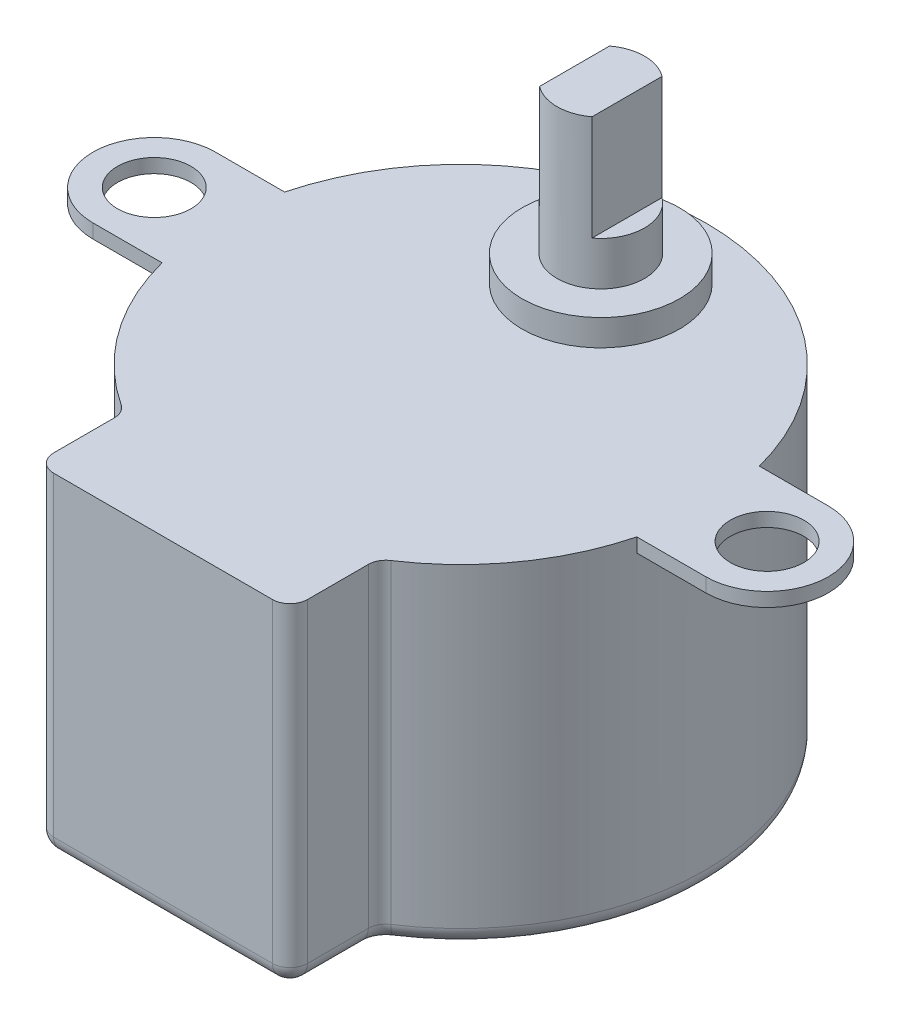
ISO-10303-21;
HEADER;
FILE_DESCRIPTION(('STEP AP214'),'2;1');
FILE_NAME('part.step','',(''),(''),'','','');
FILE_SCHEMA(('AUTOMOTIVE_DESIGN { 1 0 10303 214 1 1 1 1 }'));
ENDSEC;
DATA;
#1=APPLICATION_CONTEXT('core data for automotive mechanical design processes');
#2=APPLICATION_PROTOCOL_DEFINITION('international standard','automotive_design',2000,#1);
#3=PRODUCT_CONTEXT('',#1,'mechanical');
#4=PRODUCT('Part','Part','',(#3));
#5=PRODUCT_RELATED_PRODUCT_CATEGORY('part','',(#4));
#6=PRODUCT_DEFINITION_FORMATION('','',#4);
#7=PRODUCT_DEFINITION_CONTEXT('part definition',#1,'design');
#8=PRODUCT_DEFINITION('design','',#6,#7);
#9=PRODUCT_DEFINITION_SHAPE('','',#8);
#10=(LENGTH_UNIT() NAMED_UNIT(*) SI_UNIT(.MILLI.,.METRE.));
#11=(NAMED_UNIT(*) PLANE_ANGLE_UNIT() SI_UNIT($,.RADIAN.));
#12=(NAMED_UNIT(*) SI_UNIT($,.STERADIAN.) SOLID_ANGLE_UNIT());
#13=UNCERTAINTY_MEASURE_WITH_UNIT(LENGTH_MEASURE(1.E-05),#10,'distance_accuracy_value','');
#14=(GEOMETRIC_REPRESENTATION_CONTEXT(3) GLOBAL_UNCERTAINTY_ASSIGNED_CONTEXT((#13)) GLOBAL_UNIT_ASSIGNED_CONTEXT((#10,
#11,#12)) REPRESENTATION_CONTEXT('',''));
#15=CARTESIAN_POINT('',(0.,0.,0.));
#16=DIRECTION('',(0.,0.,1.));
#17=DIRECTION('',(1.,0.,0.));
#18=AXIS2_PLACEMENT_3D('',#15,#16,#17);
#19=CARTESIAN_POINT('',(0.,29.,-8.00000003599999));
#20=DIRECTION('',(0.,-1.,0.));
#21=DIRECTION('',(0.,0.,-1.));
#22=AXIS2_PLACEMENT_3D('',#19,#20,#21);
#23=CYLINDRICAL_SURFACE('',#22,2.5);
#24=CARTESIAN_POINT('',(0.,29.,-8.00000003599999));
#25=DIRECTION('',(0.,1.,0.));
#26=DIRECTION('',(0.,0.,1.));
#27=AXIS2_PLACEMENT_3D('',#24,#25,#26);
#28=CIRCLE('',#27,2.5);
#29=CARTESIAN_POINT('',(1.5,29.,-10.000000036));
#30=VERTEX_POINT('',#29);
#31=CARTESIAN_POINT('',(-1.5,29.,-10.000000036));
#32=VERTEX_POINT('',#31);
#33=EDGE_CURVE('E277',#30,#32,#28,.T.);
#34=ORIENTED_EDGE('',*,*,#33,.F.);
#35=DIRECTION('',(0.,1.,0.));
#36=VECTOR('',#35,1.);
#37=CARTESIAN_POINT('',(1.5,23.,-10.000000036));
#38=LINE('',#37,#36);
#39=CARTESIAN_POINT('',(1.5,23.,-10.000000036));
#40=VERTEX_POINT('',#39);
#41=EDGE_CURVE('E259',#40,#30,#38,.T.);
#42=ORIENTED_EDGE('',*,*,#41,.F.);
#43=CARTESIAN_POINT('',(0.,23.,-8.00000003599999));
#44=DIRECTION('',(0.,1.,0.));
#45=DIRECTION('',(0.,0.,1.));
#46=AXIS2_PLACEMENT_3D('',#43,#44,#45);
#47=CIRCLE('',#46,2.5);
#48=CARTESIAN_POINT('',(1.5,23.,-6.00000003599998));
#49=VERTEX_POINT('',#48);
#50=EDGE_CURVE('E253',#49,#40,#47,.T.);
#51=ORIENTED_EDGE('',*,*,#50,.F.);
#52=DIRECTION('',(0.,1.,0.));
#53=VECTOR('',#52,1.);
#54=CARTESIAN_POINT('',(1.5,23.,-6.00000003599998));
#55=LINE('',#54,#53);
#56=CARTESIAN_POINT('',(1.5,29.,-6.00000003599998));
#57=VERTEX_POINT('',#56);
#58=EDGE_CURVE('E262',#49,#57,#55,.T.);
#59=ORIENTED_EDGE('',*,*,#58,.T.);
#60=CARTESIAN_POINT('',(-1.5,29.,-6.00000003599998));
#61=VERTEX_POINT('',#60);
#62=EDGE_CURVE('E280',#61,#57,#28,.T.);
#63=ORIENTED_EDGE('',*,*,#62,.F.);
#64=DIRECTION('',(0.,1.,0.));
#65=VECTOR('',#64,1.);
#66=CARTESIAN_POINT('',(-1.5,23.,-6.00000003599998));
#67=LINE('',#66,#65);
#68=CARTESIAN_POINT('',(-1.5,23.,-6.00000003599998));
#69=VERTEX_POINT('',#68);
#70=EDGE_CURVE('E275',#69,#61,#67,.T.);
#71=ORIENTED_EDGE('',*,*,#70,.F.);
#72=CARTESIAN_POINT('',(0.,23.,-8.00000003599999));
#73=DIRECTION('',(0.,1.,0.));
#74=DIRECTION('',(0.,0.,1.));
#75=AXIS2_PLACEMENT_3D('',#72,#73,#74);
#76=CIRCLE('',#75,2.5);
#77=CARTESIAN_POINT('',(-1.5,23.,-10.000000036));
#78=VERTEX_POINT('',#77);
#79=EDGE_CURVE('E269',#78,#69,#76,.T.);
#80=ORIENTED_EDGE('',*,*,#79,.F.);
#81=DIRECTION('',(0.,1.,0.));
#82=VECTOR('',#81,1.);
#83=CARTESIAN_POINT('',(-1.5,23.,-10.000000036));
#84=LINE('',#83,#82);
#85=EDGE_CURVE('E272',#78,#32,#84,.T.);
#86=ORIENTED_EDGE('',*,*,#85,.T.);
#87=EDGE_LOOP('',(#34,#42,#51,#59,#63,#71,#80,#86));
#88=FACE_BOUND('',#87,.T.);
#89=CARTESIAN_POINT('',(0.,20.5,-8.00000003599999));
#90=DIRECTION('',(0.,1.,0.));
#91=DIRECTION('',(0.,0.,1.));
#92=AXIS2_PLACEMENT_3D('',#89,#90,#91);
#93=CIRCLE('',#92,2.5);
#94=CARTESIAN_POINT('',(0.,20.5,-5.50000003599998));
#95=VERTEX_POINT('',#94);
#96=EDGE_CURVE('E283',#95,#95,#93,.F.);
#97=ORIENTED_EDGE('',*,*,#96,.F.);
#98=EDGE_LOOP('',(#97));
#99=FACE_BOUND('',#98,.T.);
#100=ADVANCED_FACE('F47',(#88,#99),#23,.T.);
#101=CARTESIAN_POINT('',(0.,29.,-8.00000003599999));
#102=DIRECTION('',(0.,1.,0.));
#103=DIRECTION('',(0.,0.,1.));
#104=AXIS2_PLACEMENT_3D('',#101,#102,#103);
#105=PLANE('',#104);
#106=DIRECTION('',(0.,0.,1.));
#107=VECTOR('',#106,1.);
#108=CARTESIAN_POINT('',(1.5,29.,0.));
#109=LINE('',#108,#107);
#110=EDGE_CURVE('E256',#30,#57,#109,.T.);
#111=ORIENTED_EDGE('',*,*,#110,.F.);
#112=ORIENTED_EDGE('',*,*,#33,.T.);
#113=DIRECTION('',(0.,0.,1.));
#114=VECTOR('',#113,1.);
#115=CARTESIAN_POINT('',(-1.5,29.,0.));
#116=LINE('',#115,#114);
#117=EDGE_CURVE('E265',#32,#61,#116,.T.);
#118=ORIENTED_EDGE('',*,*,#117,.T.);
#119=ORIENTED_EDGE('',*,*,#62,.T.);
#120=EDGE_LOOP('',(#111,#112,#118,#119));
#121=FACE_BOUND('',#120,.T.);
#122=ADVANCED_FACE('F482',(#121),#105,.T.);
#123=CARTESIAN_POINT('',(0.,20.5,-8.00000003599999));
#124=DIRECTION('',(0.,1.,0.));
#125=DIRECTION('',(0.,0.,1.));
#126=AXIS2_PLACEMENT_3D('',#123,#124,#125);
#127=PLANE('',#126);
#128=CARTESIAN_POINT('',(0.,20.5,-8.00000003599999));
#129=DIRECTION('',(0.,1.,0.));
#130=DIRECTION('',(0.,0.,1.));
#131=AXIS2_PLACEMENT_3D('',#128,#129,#130);
#132=CIRCLE('',#131,4.5);
#133=CARTESIAN_POINT('',(0.,20.5,-3.50000003599998));
#134=VERTEX_POINT('',#133);
#135=EDGE_CURVE('E284',#134,#134,#132,.T.);
#136=ORIENTED_EDGE('',*,*,#135,.T.);
#137=EDGE_LOOP('',(#136));
#138=FACE_BOUND('',#137,.T.);
#139=ORIENTED_EDGE('',*,*,#96,.T.);
#140=EDGE_LOOP('',(#139));
#141=FACE_BOUND('',#140,.T.);
#142=ADVANCED_FACE('F488',(#138,#141),#127,.T.);
#143=CARTESIAN_POINT('',(0.,19.,0.));
#144=DIRECTION('',(0.,1.,0.));
#145=DIRECTION('',(0.,0.,1.));
#146=AXIS2_PLACEMENT_3D('',#143,#144,#145);
#147=PLANE('',#146);
#148=CARTESIAN_POINT('',(0.,19.,-8.00000003599999));
#149=DIRECTION('',(0.,1.,0.));
#150=DIRECTION('',(0.,0.,1.));
#151=AXIS2_PLACEMENT_3D('',#148,#149,#150);
#152=CIRCLE('',#151,4.5);
#153=CARTESIAN_POINT('',(0.,19.,-3.50000003599998));
#154=VERTEX_POINT('',#153);
#155=EDGE_CURVE('E288',#154,#154,#152,.T.);
#156=ORIENTED_EDGE('',*,*,#155,.F.);
#157=EDGE_LOOP('',(#156));
#158=FACE_BOUND('',#157,.T.);
#159=CARTESIAN_POINT('',(0.,19.,0.));
#160=DIRECTION('',(0.,1.,0.));
#161=DIRECTION('',(0.,0.,1.));
#162=AXIS2_PLACEMENT_3D('',#159,#160,#161);
#163=CIRCLE('',#162,14.);
#164=CARTESIAN_POINT('',(7.7,19.,11.692305161943));
#165=VERTEX_POINT('',#164);
#166=CARTESIAN_POINT('',(13.5554417210211,19.,3.49999996400002));
#167=VERTEX_POINT('',#166);
#168=EDGE_CURVE('E291',#165,#167,#163,.T.);
#169=ORIENTED_EDGE('',*,*,#168,.T.);
#170=DIRECTION('',(1.,0.,0.));
#171=VECTOR('',#170,1.);
#172=CARTESIAN_POINT('',(-17.5023321691892,19.,3.49999996400002));
#173=LINE('',#172,#171);
#174=CARTESIAN_POINT('',(17.4976678308108,19.,3.49999996400002));
#175=VERTEX_POINT('',#174);
#176=EDGE_CURVE('E242',#167,#175,#173,.T.);
#177=ORIENTED_EDGE('',*,*,#176,.T.);
#178=CARTESIAN_POINT('',(17.4976678308108,19.,-3.59999846773207E-08));
#179=DIRECTION('',(0.,1.,0.));
#180=DIRECTION('',(0.,0.,1.));
#181=AXIS2_PLACEMENT_3D('',#178,#179,#180);
#182=CIRCLE('',#181,3.5);
#183=CARTESIAN_POINT('',(17.4976678308108,19.,-3.50000003599998));
#184=VERTEX_POINT('',#183);
#185=EDGE_CURVE('E245',#175,#184,#182,.T.);
#186=ORIENTED_EDGE('',*,*,#185,.T.);
#187=DIRECTION('',(-1.,0.,0.));
#188=VECTOR('',#187,1.);
#189=CARTESIAN_POINT('',(-17.5023321691892,19.,-3.50000003599998));
#190=LINE('',#189,#188);
#191=CARTESIAN_POINT('',(13.5554417024308,19.,-3.50000003599998));
#192=VERTEX_POINT('',#191);
#193=EDGE_CURVE('E69',#184,#192,#190,.T.);
#194=ORIENTED_EDGE('',*,*,#193,.T.);
#195=CARTESIAN_POINT('',(-13.5554417024308,19.,-3.50000003599998));
#196=VERTEX_POINT('',#195);
#197=EDGE_CURVE('E295',#192,#196,#163,.T.);
#198=ORIENTED_EDGE('',*,*,#197,.T.);
#199=CARTESIAN_POINT('',(-17.5023321691892,19.,-3.50000003599998));
#200=VERTEX_POINT('',#199);
#201=EDGE_CURVE('E229',#196,#200,#190,.T.);
#202=ORIENTED_EDGE('',*,*,#201,.T.);
#203=CARTESIAN_POINT('',(-17.5023321691892,19.,-3.59999846773207E-08));
#204=DIRECTION('',(0.,1.,0.));
#205=DIRECTION('',(0.,0.,1.));
#206=AXIS2_PLACEMENT_3D('',#203,#204,#205);
#207=CIRCLE('',#206,3.5);
#208=CARTESIAN_POINT('',(-17.5023321691892,19.,3.49999996400002));
#209=VERTEX_POINT('',#208);
#210=EDGE_CURVE('E240',#200,#209,#207,.T.);
#211=ORIENTED_EDGE('',*,*,#210,.T.);
#212=CARTESIAN_POINT('',(-13.5554417210211,19.,3.49999996400002));
#213=VERTEX_POINT('',#212);
#214=EDGE_CURVE('E62',#209,#213,#173,.T.);
#215=ORIENTED_EDGE('',*,*,#214,.T.);
#216=CARTESIAN_POINT('',(-7.7,19.,11.692305161943));
#217=VERTEX_POINT('',#216);
#218=EDGE_CURVE('E296',#213,#217,#163,.T.);
#219=ORIENTED_EDGE('',*,*,#218,.T.);
#220=CARTESIAN_POINT('',(-8.25,19.,12.5274698163675));
#221=DIRECTION('',(0.,1.,0.));
#222=DIRECTION('',(0.,0.,1.));
#223=AXIS2_PLACEMENT_3D('',#220,#221,#222);
#224=CIRCLE('',#223,1.);
#225=CARTESIAN_POINT('',(-7.25,19.,12.5274698163675));
#226=VERTEX_POINT('',#225);
#227=EDGE_CURVE('E353',#217,#226,#224,.F.);
#228=ORIENTED_EDGE('',*,*,#227,.T.);
#229=DIRECTION('',(0.,0.,1.));
#230=VECTOR('',#229,1.);
#231=CARTESIAN_POINT('',(-7.25,19.,0.));
#232=LINE('',#231,#230);
#233=CARTESIAN_POINT('',(-7.25,19.,16.));
#234=VERTEX_POINT('',#233);
#235=EDGE_CURVE('E287',#226,#234,#232,.T.);
#236=ORIENTED_EDGE('',*,*,#235,.T.);
#237=CARTESIAN_POINT('',(-6.25,19.,16.));
#238=DIRECTION('',(0.,1.,0.));
#239=DIRECTION('',(0.,0.,1.));
#240=AXIS2_PLACEMENT_3D('',#237,#238,#239);
#241=CIRCLE('',#240,1.);
#242=CARTESIAN_POINT('',(-6.25,19.,17.));
#243=VERTEX_POINT('',#242);
#244=EDGE_CURVE('E349',#234,#243,#241,.T.);
#245=ORIENTED_EDGE('',*,*,#244,.T.);
#246=DIRECTION('',(1.,0.,0.));
#247=VECTOR('',#246,1.);
#248=CARTESIAN_POINT('',(-7.25,19.,17.));
#249=LINE('',#248,#247);
#250=CARTESIAN_POINT('',(6.25,19.,17.));
#251=VERTEX_POINT('',#250);
#252=EDGE_CURVE('E299',#243,#251,#249,.T.);
#253=ORIENTED_EDGE('',*,*,#252,.T.);
#254=CARTESIAN_POINT('',(6.25,19.,16.));
#255=DIRECTION('',(0.,1.,0.));
#256=DIRECTION('',(0.,0.,1.));
#257=AXIS2_PLACEMENT_3D('',#254,#255,#256);
#258=CIRCLE('',#257,1.);
#259=CARTESIAN_POINT('',(7.25,19.,16.));
#260=VERTEX_POINT('',#259);
#261=EDGE_CURVE('E347',#251,#260,#258,.T.);
#262=ORIENTED_EDGE('',*,*,#261,.T.);
#263=DIRECTION('',(0.,0.,1.));
#264=VECTOR('',#263,1.);
#265=CARTESIAN_POINT('',(7.25,19.,0.));
#266=LINE('',#265,#264);
#267=CARTESIAN_POINT('',(7.25,19.,12.5274698163675));
#268=VERTEX_POINT('',#267);
#269=EDGE_CURVE('E302',#268,#260,#266,.T.);
#270=ORIENTED_EDGE('',*,*,#269,.F.);
#271=CARTESIAN_POINT('',(8.25,19.,12.5274698163675));
#272=DIRECTION('',(0.,1.,0.));
#273=DIRECTION('',(0.,0.,1.));
#274=AXIS2_PLACEMENT_3D('',#271,#272,#273);
#275=CIRCLE('',#274,1.);
#276=EDGE_CURVE('E351',#268,#165,#275,.F.);
#277=ORIENTED_EDGE('',*,*,#276,.T.);
#278=EDGE_LOOP('',(#169,#177,#186,#194,#198,#202,#211,#215,#219,#228,#236,#245,#253,#262,#270,#277));
#279=FACE_BOUND('',#278,.T.);
#280=CARTESIAN_POINT('',(-17.5023321691892,19.,-3.59999846773207E-08));
#281=DIRECTION('',(0.,1.,0.));
#282=DIRECTION('',(0.,0.,1.));
#283=AXIS2_PLACEMENT_3D('',#280,#281,#282);
#284=CIRCLE('',#283,2.1);
#285=CARTESIAN_POINT('',(-17.5023321691892,19.,2.09999996400002));
#286=VERTEX_POINT('',#285);
#287=EDGE_CURVE('E799',#286,#286,#284,.T.);
#288=ORIENTED_EDGE('',*,*,#287,.F.);
#289=EDGE_LOOP('',(#288));
#290=FACE_BOUND('',#289,.T.);
#291=CARTESIAN_POINT('',(17.4976678308108,19.,-3.59999846773207E-08));
#292=DIRECTION('',(0.,1.,0.));
#293=DIRECTION('',(0.,0.,1.));
#294=AXIS2_PLACEMENT_3D('',#291,#292,#293);
#295=CIRCLE('',#294,2.1);
#296=CARTESIAN_POINT('',(17.4976678308108,19.,2.09999996400002));
#297=VERTEX_POINT('',#296);
#298=EDGE_CURVE('E232',#297,#297,#295,.T.);
#299=ORIENTED_EDGE('',*,*,#298,.F.);
#300=EDGE_LOOP('',(#299));
#301=FACE_BOUND('',#300,.T.);
#302=ADVANCED_FACE('F407',(#158,#279,#290,#301),#147,.T.);
#303=CARTESIAN_POINT('',(0.,0.,0.));
#304=DIRECTION('',(0.,1.,0.));
#305=DIRECTION('',(0.,0.,1.));
#306=AXIS2_PLACEMENT_3D('',#303,#304,#305);
#307=PLANE('',#306);
#308=DIRECTION('',(1.,0.,0.));
#309=VECTOR('',#308,1.);
#310=CARTESIAN_POINT('',(0.,0.,16.));
#311=LINE('',#310,#309);
#312=CARTESIAN_POINT('',(6.25,0.,16.));
#313=VERTEX_POINT('',#312);
#314=CARTESIAN_POINT('',(-6.25,0.,16.));
#315=VERTEX_POINT('',#314);
#316=EDGE_CURVE('E320',#313,#315,#311,.F.);
#317=ORIENTED_EDGE('',*,*,#316,.T.);
#318=DIRECTION('',(0.,0.,1.));
#319=VECTOR('',#318,1.);
#320=CARTESIAN_POINT('',(-6.25,0.,0.));
#321=LINE('',#320,#319);
#322=CARTESIAN_POINT('',(-6.25,0.,12.5274698163675));
#323=VERTEX_POINT('',#322);
#324=EDGE_CURVE('E325',#315,#323,#321,.F.);
#325=ORIENTED_EDGE('',*,*,#324,.T.);
#326=CARTESIAN_POINT('',(-8.25,0.,12.5274698163675));
#327=DIRECTION('',(0.,1.,0.));
#328=DIRECTION('',(0.,0.,1.));
#329=AXIS2_PLACEMENT_3D('',#326,#327,#328);
#330=CIRCLE('',#329,2.);
#331=CARTESIAN_POINT('',(-7.15,0.,10.8571405075185));
#332=VERTEX_POINT('',#331);
#333=EDGE_CURVE('E322',#332,#323,#330,.F.);
#334=ORIENTED_EDGE('',*,*,#333,.F.);
#335=CARTESIAN_POINT('',(0.,0.,0.));
#336=DIRECTION('',(0.,1.,0.));
#337=DIRECTION('',(0.,0.,1.));
#338=AXIS2_PLACEMENT_3D('',#335,#336,#337);
#339=CIRCLE('',#338,13.);
#340=CARTESIAN_POINT('',(7.15,0.,10.8571405075185));
#341=VERTEX_POINT('',#340);
#342=EDGE_CURVE('E316',#332,#341,#339,.F.);
#343=ORIENTED_EDGE('',*,*,#342,.T.);
#344=CARTESIAN_POINT('',(8.25,0.,12.5274698163675));
#345=DIRECTION('',(0.,1.,0.));
#346=DIRECTION('',(0.,0.,1.));
#347=AXIS2_PLACEMENT_3D('',#344,#345,#346);
#348=CIRCLE('',#347,2.);
#349=CARTESIAN_POINT('',(6.25,0.,12.5274698163675));
#350=VERTEX_POINT('',#349);
#351=EDGE_CURVE('E313',#350,#341,#348,.F.);
#352=ORIENTED_EDGE('',*,*,#351,.F.);
#353=DIRECTION('',(0.,0.,1.));
#354=VECTOR('',#353,1.);
#355=CARTESIAN_POINT('',(6.25,0.,17.));
#356=LINE('',#355,#354);
#357=EDGE_CURVE('E318',#350,#313,#356,.T.);
#358=ORIENTED_EDGE('',*,*,#357,.T.);
#359=EDGE_LOOP('',(#317,#325,#334,#343,#352,#358));
#360=FACE_BOUND('',#359,.T.);
#361=ADVANCED_FACE('F505',(#360),#307,.F.);
#362=CARTESIAN_POINT('',(0.,19.,0.));
#363=DIRECTION('',(0.,-1.,0.));
#364=DIRECTION('',(0.,0.,-1.));
#365=AXIS2_PLACEMENT_3D('',#362,#363,#364);
#366=CYLINDRICAL_SURFACE('',#365,14.);
#367=ORIENTED_EDGE('',*,*,#197,.F.);
#368=DIRECTION('',(0.,-1.,0.));
#369=VECTOR('',#368,1.);
#370=CARTESIAN_POINT('',(13.5554417024308,19.,-3.50000003599998));
#371=LINE('',#370,#369);
#372=CARTESIAN_POINT('',(13.5554417024308,18.2,-3.50000003599998));
#373=VERTEX_POINT('',#372);
#374=EDGE_CURVE('E12',#192,#373,#371,.T.);
#375=ORIENTED_EDGE('',*,*,#374,.T.);
#376=CARTESIAN_POINT('',(0.,18.2,0.));
#377=DIRECTION('',(0.,1.,0.));
#378=DIRECTION('',(0.,0.,1.));
#379=AXIS2_PLACEMENT_3D('',#376,#377,#378);
#380=CIRCLE('',#379,14.);
#381=CARTESIAN_POINT('',(13.5554417210211,18.2,3.49999996400002));
#382=VERTEX_POINT('',#381);
#383=EDGE_CURVE('E389',#382,#373,#380,.T.);
#384=ORIENTED_EDGE('',*,*,#383,.F.);
#385=DIRECTION('',(0.,-1.,0.));
#386=VECTOR('',#385,1.);
#387=CARTESIAN_POINT('',(13.5554417210211,19.,3.49999996400002));
#388=LINE('',#387,#386);
#389=EDGE_CURVE('E55',#382,#167,#388,.F.);
#390=ORIENTED_EDGE('',*,*,#389,.T.);
#391=ORIENTED_EDGE('',*,*,#168,.F.);
#392=DIRECTION('',(0.,-1.,0.));
#393=VECTOR('',#392,1.);
#394=CARTESIAN_POINT('',(7.7,19.,11.692305161943));
#395=LINE('',#394,#393);
#396=CARTESIAN_POINT('',(7.7,1.,11.692305161943));
#397=VERTEX_POINT('',#396);
#398=EDGE_CURVE('E345',#165,#397,#395,.T.);
#399=ORIENTED_EDGE('',*,*,#398,.T.);
#400=CARTESIAN_POINT('',(0.,1.,0.));
#401=DIRECTION('',(0.,1.,0.));
#402=DIRECTION('',(0.,0.,1.));
#403=AXIS2_PLACEMENT_3D('',#400,#401,#402);
#404=CIRCLE('',#403,14.);
#405=CARTESIAN_POINT('',(-7.7,1.,11.692305161943));
#406=VERTEX_POINT('',#405);
#407=EDGE_CURVE('E343',#397,#406,#404,.T.);
#408=ORIENTED_EDGE('',*,*,#407,.T.);
#409=DIRECTION('',(0.,-1.,0.));
#410=VECTOR('',#409,1.);
#411=CARTESIAN_POINT('',(-7.7,19.,11.692305161943));
#412=LINE('',#411,#410);
#413=EDGE_CURVE('E340',#406,#217,#412,.F.);
#414=ORIENTED_EDGE('',*,*,#413,.T.);
#415=ORIENTED_EDGE('',*,*,#218,.F.);
#416=DIRECTION('',(0.,-1.,0.));
#417=VECTOR('',#416,1.);
#418=CARTESIAN_POINT('',(-13.5554417210211,19.,3.49999996400002));
#419=LINE('',#418,#417);
#420=CARTESIAN_POINT('',(-13.5554417210211,18.2,3.49999996400002));
#421=VERTEX_POINT('',#420);
#422=EDGE_CURVE('E388',#213,#421,#419,.T.);
#423=ORIENTED_EDGE('',*,*,#422,.T.);
#424=CARTESIAN_POINT('',(-13.5554417024308,18.2,-3.50000003599998));
#425=VERTEX_POINT('',#424);
#426=EDGE_CURVE('E220',#425,#421,#380,.T.);
#427=ORIENTED_EDGE('',*,*,#426,.F.);
#428=DIRECTION('',(0.,-1.,0.));
#429=VECTOR('',#428,1.);
#430=CARTESIAN_POINT('',(-13.5554417024308,19.,-3.50000003599998));
#431=LINE('',#430,#429);
#432=EDGE_CURVE('E391',#425,#196,#431,.F.);
#433=ORIENTED_EDGE('',*,*,#432,.T.);
#434=EDGE_LOOP('',(#367,#375,#384,#390,#391,#399,#408,#414,#415,#423,#427,#433));
#435=FACE_BOUND('',#434,.T.);
#436=ADVANCED_FACE('F405',(#435),#366,.T.);
#437=CARTESIAN_POINT('',(-7.25,19.,17.));
#438=DIRECTION('',(0.,0.,-1.));
#439=DIRECTION('',(-1.,0.,0.));
#440=AXIS2_PLACEMENT_3D('',#437,#438,#439);
#441=PLANE('',#440);
#442=ORIENTED_EDGE('',*,*,#252,.F.);
#443=DIRECTION('',(0.,-1.,0.));
#444=VECTOR('',#443,1.);
#445=CARTESIAN_POINT('',(-6.25,19.,17.));
#446=LINE('',#445,#444);
#447=CARTESIAN_POINT('',(-6.25,1.,17.));
#448=VERTEX_POINT('',#447);
#449=EDGE_CURVE('E332',#243,#448,#446,.T.);
#450=ORIENTED_EDGE('',*,*,#449,.T.);
#451=DIRECTION('',(1.,0.,0.));
#452=VECTOR('',#451,1.);
#453=CARTESIAN_POINT('',(-7.25,1.,17.));
#454=LINE('',#453,#452);
#455=CARTESIAN_POINT('',(6.25,1.,17.));
#456=VERTEX_POINT('',#455);
#457=EDGE_CURVE('E330',#448,#456,#454,.T.);
#458=ORIENTED_EDGE('',*,*,#457,.T.);
#459=DIRECTION('',(0.,-1.,0.));
#460=VECTOR('',#459,1.);
#461=CARTESIAN_POINT('',(6.25,19.,17.));
#462=LINE('',#461,#460);
#463=EDGE_CURVE('E328',#456,#251,#462,.F.);
#464=ORIENTED_EDGE('',*,*,#463,.T.);
#465=EDGE_LOOP('',(#442,#450,#458,#464));
#466=FACE_BOUND('',#465,.T.);
#467=ADVANCED_FACE('F431',(#466),#441,.F.);
#468=CARTESIAN_POINT('',(7.25,19.,0.));
#469=DIRECTION('',(1.,0.,0.));
#470=DIRECTION('',(0.,0.,-1.));
#471=AXIS2_PLACEMENT_3D('',#468,#469,#470);
#472=PLANE('',#471);
#473=DIRECTION('',(0.,0.,1.));
#474=VECTOR('',#473,1.);
#475=CARTESIAN_POINT('',(7.25,1.,11.9765395670035));
#476=LINE('',#475,#474);
#477=CARTESIAN_POINT('',(7.25,1.,16.));
#478=VERTEX_POINT('',#477);
#479=CARTESIAN_POINT('',(7.25,1.,12.5274698163675));
#480=VERTEX_POINT('',#479);
#481=EDGE_CURVE('E336',#478,#480,#476,.F.);
#482=ORIENTED_EDGE('',*,*,#481,.T.);
#483=DIRECTION('',(0.,-1.,0.));
#484=VECTOR('',#483,1.);
#485=CARTESIAN_POINT('',(7.25,19.,12.5274698163675));
#486=LINE('',#485,#484);
#487=EDGE_CURVE('E338',#480,#268,#486,.F.);
#488=ORIENTED_EDGE('',*,*,#487,.T.);
#489=ORIENTED_EDGE('',*,*,#269,.T.);
#490=DIRECTION('',(0.,-1.,0.));
#491=VECTOR('',#490,1.);
#492=CARTESIAN_POINT('',(7.25,0.,16.));
#493=LINE('',#492,#491);
#494=EDGE_CURVE('E334',#260,#478,#493,.T.);
#495=ORIENTED_EDGE('',*,*,#494,.T.);
#496=EDGE_LOOP('',(#482,#488,#489,#495));
#497=FACE_BOUND('',#496,.T.);
#498=ADVANCED_FACE('F450',(#497),#472,.T.);
#499=CARTESIAN_POINT('',(-7.25,19.,0.));
#500=DIRECTION('',(1.,0.,0.));
#501=DIRECTION('',(0.,0.,-1.));
#502=AXIS2_PLACEMENT_3D('',#499,#500,#501);
#503=PLANE('',#502);
#504=ORIENTED_EDGE('',*,*,#235,.F.);
#505=DIRECTION('',(0.,1.,0.));
#506=VECTOR('',#505,1.);
#507=CARTESIAN_POINT('',(-7.25,0.,12.5274698163675));
#508=LINE('',#507,#506);
#509=CARTESIAN_POINT('',(-7.25,1.,12.5274698163675));
#510=VERTEX_POINT('',#509);
#511=EDGE_CURVE('E311',#226,#510,#508,.F.);
#512=ORIENTED_EDGE('',*,*,#511,.T.);
#513=DIRECTION('',(0.,0.,1.));
#514=VECTOR('',#513,1.);
#515=CARTESIAN_POINT('',(-7.25,1.,0.));
#516=LINE('',#515,#514);
#517=CARTESIAN_POINT('',(-7.25,1.,16.));
#518=VERTEX_POINT('',#517);
#519=EDGE_CURVE('E308',#510,#518,#516,.T.);
#520=ORIENTED_EDGE('',*,*,#519,.T.);
#521=DIRECTION('',(0.,-1.,0.));
#522=VECTOR('',#521,1.);
#523=CARTESIAN_POINT('',(-7.25,19.,16.));
#524=LINE('',#523,#522);
#525=EDGE_CURVE('E294',#518,#234,#524,.F.);
#526=ORIENTED_EDGE('',*,*,#525,.T.);
#527=EDGE_LOOP('',(#504,#512,#520,#526));
#528=FACE_BOUND('',#527,.T.);
#529=ADVANCED_FACE('F420',(#528),#503,.F.);
#530=CARTESIAN_POINT('',(0.,20.5,-8.00000003599999));
#531=DIRECTION('',(0.,-1.,0.));
#532=DIRECTION('',(0.,0.,-1.));
#533=AXIS2_PLACEMENT_3D('',#530,#531,#532);
#534=CYLINDRICAL_SURFACE('',#533,4.5);
#535=ORIENTED_EDGE('',*,*,#135,.F.);
#536=EDGE_LOOP('',(#535));
#537=FACE_BOUND('',#536,.T.);
#538=ORIENTED_EDGE('',*,*,#155,.T.);
#539=EDGE_LOOP('',(#538));
#540=FACE_BOUND('',#539,.T.);
#541=ADVANCED_FACE('F498',(#537,#540),#534,.T.);
#542=CARTESIAN_POINT('',(-1.5,23.,0.));
#543=DIRECTION('',(-1.,0.,0.));
#544=DIRECTION('',(0.,0.,1.));
#545=AXIS2_PLACEMENT_3D('',#542,#543,#544);
#546=PLANE('',#545);
#547=ORIENTED_EDGE('',*,*,#117,.F.);
#548=ORIENTED_EDGE('',*,*,#85,.F.);
#549=DIRECTION('',(0.,0.,1.));
#550=VECTOR('',#549,1.);
#551=CARTESIAN_POINT('',(-1.5,23.,0.));
#552=LINE('',#551,#550);
#553=EDGE_CURVE('E267',#78,#69,#552,.T.);
#554=ORIENTED_EDGE('',*,*,#553,.T.);
#555=ORIENTED_EDGE('',*,*,#70,.T.);
#556=EDGE_LOOP('',(#547,#548,#554,#555));
#557=FACE_BOUND('',#556,.T.);
#558=ADVANCED_FACE('F501',(#557),#546,.T.);
#559=CARTESIAN_POINT('',(0.,23.,0.));
#560=DIRECTION('',(0.,1.,0.));
#561=DIRECTION('',(0.,0.,1.));
#562=AXIS2_PLACEMENT_3D('',#559,#560,#561);
#563=PLANE('',#562);
#564=ORIENTED_EDGE('',*,*,#553,.F.);
#565=ORIENTED_EDGE('',*,*,#79,.T.);
#566=EDGE_LOOP('',(#564,#565));
#567=FACE_BOUND('',#566,.T.);
#568=ADVANCED_FACE('F534',(#567),#563,.T.);
#569=CARTESIAN_POINT('',(1.5,23.,0.));
#570=DIRECTION('',(-1.,0.,0.));
#571=DIRECTION('',(0.,0.,1.));
#572=AXIS2_PLACEMENT_3D('',#569,#570,#571);
#573=PLANE('',#572);
#574=ORIENTED_EDGE('',*,*,#110,.T.);
#575=ORIENTED_EDGE('',*,*,#58,.F.);
#576=DIRECTION('',(0.,0.,1.));
#577=VECTOR('',#576,1.);
#578=CARTESIAN_POINT('',(1.5,23.,0.));
#579=LINE('',#578,#577);
#580=EDGE_CURVE('E255',#40,#49,#579,.T.);
#581=ORIENTED_EDGE('',*,*,#580,.F.);
#582=ORIENTED_EDGE('',*,*,#41,.T.);
#583=EDGE_LOOP('',(#574,#575,#581,#582));
#584=FACE_BOUND('',#583,.T.);
#585=ADVANCED_FACE('F542',(#584),#573,.F.);
#586=CARTESIAN_POINT('',(0.,23.,0.));
#587=DIRECTION('',(0.,1.,0.));
#588=DIRECTION('',(0.,0.,1.));
#589=AXIS2_PLACEMENT_3D('',#586,#587,#588);
#590=PLANE('',#589);
#591=ORIENTED_EDGE('',*,*,#50,.T.);
#592=ORIENTED_EDGE('',*,*,#580,.T.);
#593=EDGE_LOOP('',(#591,#592));
#594=FACE_BOUND('',#593,.T.);
#595=ADVANCED_FACE('F550',(#594),#590,.T.);
#596=CARTESIAN_POINT('',(8.25,19.,12.5274698163675));
#597=DIRECTION('',(0.,-1.,0.));
#598=DIRECTION('',(0.,0.,-1.));
#599=AXIS2_PLACEMENT_3D('',#596,#597,#598);
#600=CYLINDRICAL_SURFACE('',#599,1.);
#601=ORIENTED_EDGE('',*,*,#276,.F.);
#602=ORIENTED_EDGE('',*,*,#487,.F.);
#603=CARTESIAN_POINT('',(8.25,1.,12.5274698163675));
#604=DIRECTION('',(0.,1.,0.));
#605=DIRECTION('',(0.,0.,1.));
#606=AXIS2_PLACEMENT_3D('',#603,#604,#605);
#607=CIRCLE('',#606,1.);
#608=EDGE_CURVE('E382',#397,#480,#607,.T.);
#609=ORIENTED_EDGE('',*,*,#608,.F.);
#610=ORIENTED_EDGE('',*,*,#398,.F.);
#611=EDGE_LOOP('',(#601,#602,#609,#610));
#612=FACE_BOUND('',#611,.T.);
#613=ADVANCED_FACE('F49',(#612),#600,.F.);
#614=CARTESIAN_POINT('',(6.25,19.,16.));
#615=DIRECTION('',(0.,1.,0.));
#616=DIRECTION('',(0.,0.,1.));
#617=AXIS2_PLACEMENT_3D('',#614,#615,#616);
#618=CYLINDRICAL_SURFACE('',#617,1.);
#619=ORIENTED_EDGE('',*,*,#261,.F.);
#620=ORIENTED_EDGE('',*,*,#463,.F.);
#621=CARTESIAN_POINT('',(6.25,1.,16.));
#622=DIRECTION('',(0.,-1.,0.));
#623=DIRECTION('',(0.,0.,-1.));
#624=AXIS2_PLACEMENT_3D('',#621,#622,#623);
#625=CIRCLE('',#624,1.);
#626=EDGE_CURVE('E379',#478,#456,#625,.T.);
#627=ORIENTED_EDGE('',*,*,#626,.F.);
#628=ORIENTED_EDGE('',*,*,#494,.F.);
#629=EDGE_LOOP('',(#619,#620,#627,#628));
#630=FACE_BOUND('',#629,.T.);
#631=ADVANCED_FACE('F446',(#630),#618,.T.);
#632=CARTESIAN_POINT('',(6.25,1.,0.));
#633=DIRECTION('',(0.,0.,-1.));
#634=DIRECTION('',(-1.,0.,0.));
#635=AXIS2_PLACEMENT_3D('',#632,#633,#634);
#636=CYLINDRICAL_SURFACE('',#635,1.);
#637=CARTESIAN_POINT('',(6.25,1.,16.));
#638=DIRECTION('',(0.,0.,1.));
#639=DIRECTION('',(1.,0.,0.));
#640=AXIS2_PLACEMENT_3D('',#637,#638,#639);
#641=CIRCLE('',#640,1.);
#642=EDGE_CURVE('E376',#313,#478,#641,.T.);
#643=ORIENTED_EDGE('',*,*,#642,.F.);
#644=ORIENTED_EDGE('',*,*,#357,.F.);
#645=CARTESIAN_POINT('',(6.25,1.,12.5274698163675));
#646=DIRECTION('',(0.,0.,-1.));
#647=DIRECTION('',(-1.,0.,0.));
#648=AXIS2_PLACEMENT_3D('',#645,#646,#647);
#649=CIRCLE('',#648,1.);
#650=EDGE_CURVE('E261',#480,#350,#649,.T.);
#651=ORIENTED_EDGE('',*,*,#650,.F.);
#652=ORIENTED_EDGE('',*,*,#481,.F.);
#653=EDGE_LOOP('',(#643,#644,#651,#652));
#654=FACE_BOUND('',#653,.T.);
#655=ADVANCED_FACE('F460',(#654),#636,.T.);
#656=CARTESIAN_POINT('',(8.25,1.,12.5274698163675));
#657=DIRECTION('',(0.,1.,0.));
#658=DIRECTION('',(0.,0.,1.));
#659=AXIS2_PLACEMENT_3D('',#656,#657,#658);
#660=TOROIDAL_SURFACE('',#659,2.,1.);
#661=ORIENTED_EDGE('',*,*,#650,.T.);
#662=ORIENTED_EDGE('',*,*,#351,.T.);
#663=CARTESIAN_POINT('',(7.15,1.,10.8571405075185));
#664=DIRECTION('',(-0.835164654424503,0.,0.55));
#665=DIRECTION('',(0.55,0.,0.835164654424503));
#666=AXIS2_PLACEMENT_3D('',#663,#664,#665);
#667=CIRCLE('',#666,1.);
#668=EDGE_CURVE('E373',#397,#341,#667,.F.);
#669=ORIENTED_EDGE('',*,*,#668,.F.);
#670=ORIENTED_EDGE('',*,*,#608,.T.);
#671=EDGE_LOOP('',(#661,#662,#669,#670));
#672=FACE_BOUND('',#671,.T.);
#673=ADVANCED_FACE('F462',(#672),#660,.T.);
#674=CARTESIAN_POINT('',(6.25,1.,16.));
#675=DIRECTION('',(0.,0.,1.));
#676=DIRECTION('',(1.,0.,0.));
#677=AXIS2_PLACEMENT_3D('',#674,#675,#676);
#678=SPHERICAL_SURFACE('',#677,1.);
#679=ORIENTED_EDGE('',*,*,#642,.T.);
#680=ORIENTED_EDGE('',*,*,#626,.T.);
#681=CARTESIAN_POINT('',(6.25,1.,16.));
#682=DIRECTION('',(1.,0.,0.));
#683=DIRECTION('',(0.,0.,-1.));
#684=AXIS2_PLACEMENT_3D('',#681,#682,#683);
#685=CIRCLE('',#684,1.);
#686=EDGE_CURVE('E370',#313,#456,#685,.F.);
#687=ORIENTED_EDGE('',*,*,#686,.F.);
#688=EDGE_LOOP('',(#679,#680,#687));
#689=FACE_BOUND('',#688,.T.);
#690=ADVANCED_FACE('F440',(#689),#678,.T.);
#691=CARTESIAN_POINT('',(0.,1.,0.));
#692=DIRECTION('',(0.,1.,0.));
#693=DIRECTION('',(0.,0.,1.));
#694=AXIS2_PLACEMENT_3D('',#691,#692,#693);
#695=TOROIDAL_SURFACE('',#694,13.,1.);
#696=ORIENTED_EDGE('',*,*,#668,.T.);
#697=ORIENTED_EDGE('',*,*,#342,.F.);
#698=CARTESIAN_POINT('',(-7.15,1.,10.8571405075185));
#699=DIRECTION('',(0.835164654424503,0.,0.55));
#700=DIRECTION('',(0.55,0.,-0.835164654424503));
#701=AXIS2_PLACEMENT_3D('',#698,#699,#700);
#702=CIRCLE('',#701,1.);
#703=EDGE_CURVE('E367',#406,#332,#702,.T.);
#704=ORIENTED_EDGE('',*,*,#703,.F.);
#705=ORIENTED_EDGE('',*,*,#407,.F.);
#706=EDGE_LOOP('',(#696,#697,#704,#705));
#707=FACE_BOUND('',#706,.T.);
#708=ADVANCED_FACE('F465',(#707),#695,.T.);
#709=CARTESIAN_POINT('',(-8.25,19.,12.5274698163675));
#710=DIRECTION('',(0.,-1.,0.));
#711=DIRECTION('',(0.,0.,-1.));
#712=AXIS2_PLACEMENT_3D('',#709,#710,#711);
#713=CYLINDRICAL_SURFACE('',#712,1.);
#714=ORIENTED_EDGE('',*,*,#227,.F.);
#715=ORIENTED_EDGE('',*,*,#413,.F.);
#716=CARTESIAN_POINT('',(-8.25,1.,12.5274698163675));
#717=DIRECTION('',(0.,1.,0.));
#718=DIRECTION('',(0.,0.,1.));
#719=AXIS2_PLACEMENT_3D('',#716,#717,#718);
#720=CIRCLE('',#719,1.);
#721=EDGE_CURVE('E364',#510,#406,#720,.T.);
#722=ORIENTED_EDGE('',*,*,#721,.F.);
#723=ORIENTED_EDGE('',*,*,#511,.F.);
#724=EDGE_LOOP('',(#714,#715,#722,#723));
#725=FACE_BOUND('',#724,.T.);
#726=ADVANCED_FACE('F417',(#725),#713,.F.);
#727=CARTESIAN_POINT('',(-6.25,19.,16.));
#728=DIRECTION('',(0.,-1.,0.));
#729=DIRECTION('',(0.,0.,-1.));
#730=AXIS2_PLACEMENT_3D('',#727,#728,#729);
#731=CYLINDRICAL_SURFACE('',#730,1.);
#732=ORIENTED_EDGE('',*,*,#244,.F.);
#733=ORIENTED_EDGE('',*,*,#525,.F.);
#734=CARTESIAN_POINT('',(-6.25,1.,16.));
#735=DIRECTION('',(0.,-1.,0.));
#736=DIRECTION('',(0.,0.,-1.));
#737=AXIS2_PLACEMENT_3D('',#734,#735,#736);
#738=CIRCLE('',#737,1.);
#739=EDGE_CURVE('E361',#448,#518,#738,.T.);
#740=ORIENTED_EDGE('',*,*,#739,.F.);
#741=ORIENTED_EDGE('',*,*,#449,.F.);
#742=EDGE_LOOP('',(#732,#733,#740,#741));
#743=FACE_BOUND('',#742,.T.);
#744=ADVANCED_FACE('F427',(#743),#731,.T.);
#745=CARTESIAN_POINT('',(-7.25,1.,16.));
#746=DIRECTION('',(1.,0.,0.));
#747=DIRECTION('',(0.,0.,-1.));
#748=AXIS2_PLACEMENT_3D('',#745,#746,#747);
#749=CYLINDRICAL_SURFACE('',#748,1.);
#750=ORIENTED_EDGE('',*,*,#686,.T.);
#751=ORIENTED_EDGE('',*,*,#457,.F.);
#752=CARTESIAN_POINT('',(-6.25,1.,16.));
#753=DIRECTION('',(-1.,0.,0.));
#754=DIRECTION('',(0.,0.,1.));
#755=AXIS2_PLACEMENT_3D('',#752,#753,#754);
#756=CIRCLE('',#755,1.);
#757=EDGE_CURVE('E358',#315,#448,#756,.T.);
#758=ORIENTED_EDGE('',*,*,#757,.F.);
#759=ORIENTED_EDGE('',*,*,#316,.F.);
#760=EDGE_LOOP('',(#750,#751,#758,#759));
#761=FACE_BOUND('',#760,.T.);
#762=ADVANCED_FACE('F435',(#761),#749,.T.);
#763=CARTESIAN_POINT('',(-8.25,1.,12.5274698163675));
#764=DIRECTION('',(0.,1.,0.));
#765=DIRECTION('',(0.,0.,1.));
#766=AXIS2_PLACEMENT_3D('',#763,#764,#765);
#767=TOROIDAL_SURFACE('',#766,2.,1.);
#768=ORIENTED_EDGE('',*,*,#703,.T.);
#769=ORIENTED_EDGE('',*,*,#333,.T.);
#770=CARTESIAN_POINT('',(-6.25,1.,12.5274698163675));
#771=DIRECTION('',(0.,0.,-1.));
#772=DIRECTION('',(-1.,0.,0.));
#773=AXIS2_PLACEMENT_3D('',#770,#771,#772);
#774=CIRCLE('',#773,1.);
#775=EDGE_CURVE('E356',#510,#323,#774,.F.);
#776=ORIENTED_EDGE('',*,*,#775,.F.);
#777=ORIENTED_EDGE('',*,*,#721,.T.);
#778=EDGE_LOOP('',(#768,#769,#776,#777));
#779=FACE_BOUND('',#778,.T.);
#780=ADVANCED_FACE('F467',(#779),#767,.T.);
#781=CARTESIAN_POINT('',(-6.25,1.,16.));
#782=DIRECTION('',(0.,0.,1.));
#783=DIRECTION('',(1.,0.,0.));
#784=AXIS2_PLACEMENT_3D('',#781,#782,#783);
#785=SPHERICAL_SURFACE('',#784,1.);
#786=ORIENTED_EDGE('',*,*,#757,.T.);
#787=ORIENTED_EDGE('',*,*,#739,.T.);
#788=CARTESIAN_POINT('',(-6.25,1.,16.));
#789=DIRECTION('',(0.,0.,1.));
#790=DIRECTION('',(1.,0.,0.));
#791=AXIS2_PLACEMENT_3D('',#788,#789,#790);
#792=CIRCLE('',#791,1.);
#793=EDGE_CURVE('E248',#315,#518,#792,.F.);
#794=ORIENTED_EDGE('',*,*,#793,.F.);
#795=EDGE_LOOP('',(#786,#787,#794));
#796=FACE_BOUND('',#795,.T.);
#797=ADVANCED_FACE('F472',(#796),#785,.T.);
#798=CARTESIAN_POINT('',(-6.25,1.,0.));
#799=DIRECTION('',(0.,0.,1.));
#800=DIRECTION('',(1.,0.,0.));
#801=AXIS2_PLACEMENT_3D('',#798,#799,#800);
#802=CYLINDRICAL_SURFACE('',#801,1.);
#803=ORIENTED_EDGE('',*,*,#775,.T.);
#804=ORIENTED_EDGE('',*,*,#324,.F.);
#805=ORIENTED_EDGE('',*,*,#793,.T.);
#806=ORIENTED_EDGE('',*,*,#519,.F.);
#807=EDGE_LOOP('',(#803,#804,#805,#806));
#808=FACE_BOUND('',#807,.T.);
#809=ADVANCED_FACE('F469',(#808),#802,.T.);
#810=CARTESIAN_POINT('',(-17.5023321691892,18.2,-3.59999846773207E-08));
#811=DIRECTION('',(0.,1.,0.));
#812=DIRECTION('',(0.,0.,1.));
#813=AXIS2_PLACEMENT_3D('',#810,#811,#812);
#814=CYLINDRICAL_SURFACE('',#813,3.5);
#815=ORIENTED_EDGE('',*,*,#210,.F.);
#816=DIRECTION('',(0.,1.,0.));
#817=VECTOR('',#816,1.);
#818=CARTESIAN_POINT('',(-17.5023321691892,18.2,-3.50000003599998));
#819=LINE('',#818,#817);
#820=CARTESIAN_POINT('',(-17.5023321691892,18.2,-3.50000003599998));
#821=VERTEX_POINT('',#820);
#822=EDGE_CURVE('E227',#821,#200,#819,.T.);
#823=ORIENTED_EDGE('',*,*,#822,.F.);
#824=CARTESIAN_POINT('',(-17.5023321691892,18.2,-3.59999846773207E-08));
#825=DIRECTION('',(0.,1.,0.));
#826=DIRECTION('',(0.,0.,1.));
#827=AXIS2_PLACEMENT_3D('',#824,#825,#826);
#828=CIRCLE('',#827,3.5);
#829=CARTESIAN_POINT('',(-17.5023321691892,18.2,3.49999996400002));
#830=VERTEX_POINT('',#829);
#831=EDGE_CURVE('E218',#821,#830,#828,.T.);
#832=ORIENTED_EDGE('',*,*,#831,.T.);
#833=DIRECTION('',(0.,1.,0.));
#834=VECTOR('',#833,1.);
#835=CARTESIAN_POINT('',(-17.5023321691892,18.2,3.49999996400002));
#836=LINE('',#835,#834);
#837=EDGE_CURVE('E203',#830,#209,#836,.T.);
#838=ORIENTED_EDGE('',*,*,#837,.T.);
#839=EDGE_LOOP('',(#815,#823,#832,#838));
#840=FACE_BOUND('',#839,.T.);
#841=ADVANCED_FACE('F225',(#840),#814,.T.);
#842=CARTESIAN_POINT('',(-17.5023321691892,18.2,-3.59999846773207E-08));
#843=DIRECTION('',(0.,1.,0.));
#844=DIRECTION('',(0.,0.,1.));
#845=AXIS2_PLACEMENT_3D('',#842,#843,#844);
#846=CYLINDRICAL_SURFACE('',#845,2.1);
#847=CARTESIAN_POINT('',(-17.5023321691892,18.2,-3.59999846773207E-08));
#848=DIRECTION('',(0.,1.,0.));
#849=DIRECTION('',(0.,0.,1.));
#850=AXIS2_PLACEMENT_3D('',#847,#848,#849);
#851=CIRCLE('',#850,2.1);
#852=CARTESIAN_POINT('',(-17.5023321691892,18.2,2.09999996400002));
#853=VERTEX_POINT('',#852);
#854=EDGE_CURVE('E797',#853,#853,#851,.T.);
#855=ORIENTED_EDGE('',*,*,#854,.F.);
#856=EDGE_LOOP('',(#855));
#857=FACE_BOUND('',#856,.T.);
#858=ORIENTED_EDGE('',*,*,#287,.T.);
#859=EDGE_LOOP('',(#858));
#860=FACE_BOUND('',#859,.T.);
#861=ADVANCED_FACE('F708',(#857,#860),#846,.F.);
#862=CARTESIAN_POINT('',(-17.5023321691892,18.2,-3.59999846773207E-08));
#863=DIRECTION('',(0.,1.,0.));
#864=DIRECTION('',(0.,0.,1.));
#865=AXIS2_PLACEMENT_3D('',#862,#863,#864);
#866=PLANE('',#865);
#867=ORIENTED_EDGE('',*,*,#854,.T.);
#868=EDGE_LOOP('',(#867));
#869=FACE_BOUND('',#868,.T.);
#870=DIRECTION('',(-1.,0.,0.));
#871=VECTOR('',#870,1.);
#872=CARTESIAN_POINT('',(-17.5023321691892,18.2,-3.50000003599998));
#873=LINE('',#872,#871);
#874=EDGE_CURVE('E237',#425,#821,#873,.T.);
#875=ORIENTED_EDGE('',*,*,#874,.F.);
#876=ORIENTED_EDGE('',*,*,#426,.T.);
#877=DIRECTION('',(1.,0.,0.));
#878=VECTOR('',#877,1.);
#879=CARTESIAN_POINT('',(-17.5023321691892,18.2,3.49999996400002));
#880=LINE('',#879,#878);
#881=EDGE_CURVE('E206',#830,#421,#880,.T.);
#882=ORIENTED_EDGE('',*,*,#881,.F.);
#883=ORIENTED_EDGE('',*,*,#831,.F.);
#884=EDGE_LOOP('',(#875,#876,#882,#883));
#885=FACE_BOUND('',#884,.T.);
#886=ADVANCED_FACE('F217',(#869,#885),#866,.F.);
#887=CARTESIAN_POINT('',(-17.5023321691892,18.2,3.49999996400002));
#888=DIRECTION('',(0.,0.,1.));
#889=DIRECTION('',(1.,0.,0.));
#890=AXIS2_PLACEMENT_3D('',#887,#888,#889);
#891=PLANE('',#890);
#892=ORIENTED_EDGE('',*,*,#422,.F.);
#893=ORIENTED_EDGE('',*,*,#214,.F.);
#894=ORIENTED_EDGE('',*,*,#837,.F.);
#895=ORIENTED_EDGE('',*,*,#881,.T.);
#896=EDGE_LOOP('',(#892,#893,#894,#895));
#897=FACE_BOUND('',#896,.T.);
#898=ADVANCED_FACE('F205',(#897),#891,.T.);
#899=CARTESIAN_POINT('',(-17.5023321691892,18.2,-3.50000003599998));
#900=DIRECTION('',(0.,0.,-1.));
#901=DIRECTION('',(-1.,0.,0.));
#902=AXIS2_PLACEMENT_3D('',#899,#900,#901);
#903=PLANE('',#902);
#904=ORIENTED_EDGE('',*,*,#432,.F.);
#905=ORIENTED_EDGE('',*,*,#874,.T.);
#906=ORIENTED_EDGE('',*,*,#822,.T.);
#907=ORIENTED_EDGE('',*,*,#201,.F.);
#908=EDGE_LOOP('',(#904,#905,#906,#907));
#909=FACE_BOUND('',#908,.T.);
#910=ADVANCED_FACE('F732',(#909),#903,.T.);
#911=ORIENTED_EDGE('',*,*,#374,.F.);
#912=ORIENTED_EDGE('',*,*,#193,.F.);
#913=DIRECTION('',(0.,1.,0.));
#914=VECTOR('',#913,1.);
#915=CARTESIAN_POINT('',(17.4976678308108,18.2,-3.50000003599998));
#916=LINE('',#915,#914);
#917=CARTESIAN_POINT('',(17.4976678308108,18.2,-3.50000003599998));
#918=VERTEX_POINT('',#917);
#919=EDGE_CURVE('E249',#918,#184,#916,.T.);
#920=ORIENTED_EDGE('',*,*,#919,.F.);
#921=EDGE_CURVE('E212',#918,#373,#873,.T.);
#922=ORIENTED_EDGE('',*,*,#921,.T.);
#923=EDGE_LOOP('',(#911,#912,#920,#922));
#924=FACE_BOUND('',#923,.T.);
#925=ADVANCED_FACE('F403',(#924),#903,.T.);
#926=ORIENTED_EDGE('',*,*,#389,.F.);
#927=CARTESIAN_POINT('',(17.4976678308108,18.2,3.49999996400002));
#928=VERTEX_POINT('',#927);
#929=EDGE_CURVE('E222',#382,#928,#880,.T.);
#930=ORIENTED_EDGE('',*,*,#929,.T.);
#931=DIRECTION('',(0.,1.,0.));
#932=VECTOR('',#931,1.);
#933=CARTESIAN_POINT('',(17.4976678308108,18.2,3.49999996400002));
#934=LINE('',#933,#932);
#935=EDGE_CURVE('E211',#928,#175,#934,.T.);
#936=ORIENTED_EDGE('',*,*,#935,.T.);
#937=ORIENTED_EDGE('',*,*,#176,.F.);
#938=EDGE_LOOP('',(#926,#930,#936,#937));
#939=FACE_BOUND('',#938,.T.);
#940=ADVANCED_FACE('F734',(#939),#891,.T.);
#941=CARTESIAN_POINT('',(17.4976678308108,18.2,-3.59999846773207E-08));
#942=DIRECTION('',(0.,1.,0.));
#943=DIRECTION('',(0.,0.,1.));
#944=AXIS2_PLACEMENT_3D('',#941,#942,#943);
#945=CIRCLE('',#944,2.1);
#946=CARTESIAN_POINT('',(17.4976678308108,18.2,2.09999996400002));
#947=VERTEX_POINT('',#946);
#948=EDGE_CURVE('E243',#947,#947,#945,.T.);
#949=ORIENTED_EDGE('',*,*,#948,.T.);
#950=EDGE_LOOP('',(#949));
#951=FACE_BOUND('',#950,.T.);
#952=ORIENTED_EDGE('',*,*,#929,.F.);
#953=ORIENTED_EDGE('',*,*,#383,.T.);
#954=ORIENTED_EDGE('',*,*,#921,.F.);
#955=CARTESIAN_POINT('',(17.4976678308108,18.2,-3.59999846773207E-08));
#956=DIRECTION('',(0.,1.,0.));
#957=DIRECTION('',(0.,0.,1.));
#958=AXIS2_PLACEMENT_3D('',#955,#956,#957);
#959=CIRCLE('',#958,3.5);
#960=EDGE_CURVE('E221',#928,#918,#959,.T.);
#961=ORIENTED_EDGE('',*,*,#960,.F.);
#962=EDGE_LOOP('',(#952,#953,#954,#961));
#963=FACE_BOUND('',#962,.T.);
#964=ADVANCED_FACE('F400',(#951,#963),#866,.F.);
#965=CARTESIAN_POINT('',(17.4976678308108,18.2,-3.59999846773207E-08));
#966=DIRECTION('',(0.,1.,0.));
#967=DIRECTION('',(0.,0.,1.));
#968=AXIS2_PLACEMENT_3D('',#965,#966,#967);
#969=CYLINDRICAL_SURFACE('',#968,3.5);
#970=ORIENTED_EDGE('',*,*,#185,.F.);
#971=ORIENTED_EDGE('',*,*,#935,.F.);
#972=ORIENTED_EDGE('',*,*,#960,.T.);
#973=ORIENTED_EDGE('',*,*,#919,.T.);
#974=EDGE_LOOP('',(#970,#971,#972,#973));
#975=FACE_BOUND('',#974,.T.);
#976=ADVANCED_FACE('F762',(#975),#969,.T.);
#977=CARTESIAN_POINT('',(17.4976678308108,18.2,-3.59999846773207E-08));
#978=DIRECTION('',(0.,1.,0.));
#979=DIRECTION('',(0.,0.,1.));
#980=AXIS2_PLACEMENT_3D('',#977,#978,#979);
#981=CYLINDRICAL_SURFACE('',#980,2.1);
#982=ORIENTED_EDGE('',*,*,#948,.F.);
#983=EDGE_LOOP('',(#982));
#984=FACE_BOUND('',#983,.T.);
#985=ORIENTED_EDGE('',*,*,#298,.T.);
#986=EDGE_LOOP('',(#985));
#987=FACE_BOUND('',#986,.T.);
#988=ADVANCED_FACE('F770',(#984,#987),#981,.F.);
#989=CLOSED_SHELL('',(#100,#122,#142,#302,#361,#436,#467,#498,#529,#541,#558,#568,#585,#595,
#613,#631,#655,#673,#690,#708,#726,#744,#762,#780,#797,#809,#841,#861,#886,#898,#910,#925,#940,
#964,#976,#988));
#990=MANIFOLD_SOLID_BREP('B2',#989);
#991=ADVANCED_BREP_SHAPE_REPRESENTATION('',(#18,#990),#14);
#992=SHAPE_DEFINITION_REPRESENTATION(#9,#991);
ENDSEC;
END-ISO-10303-21;
